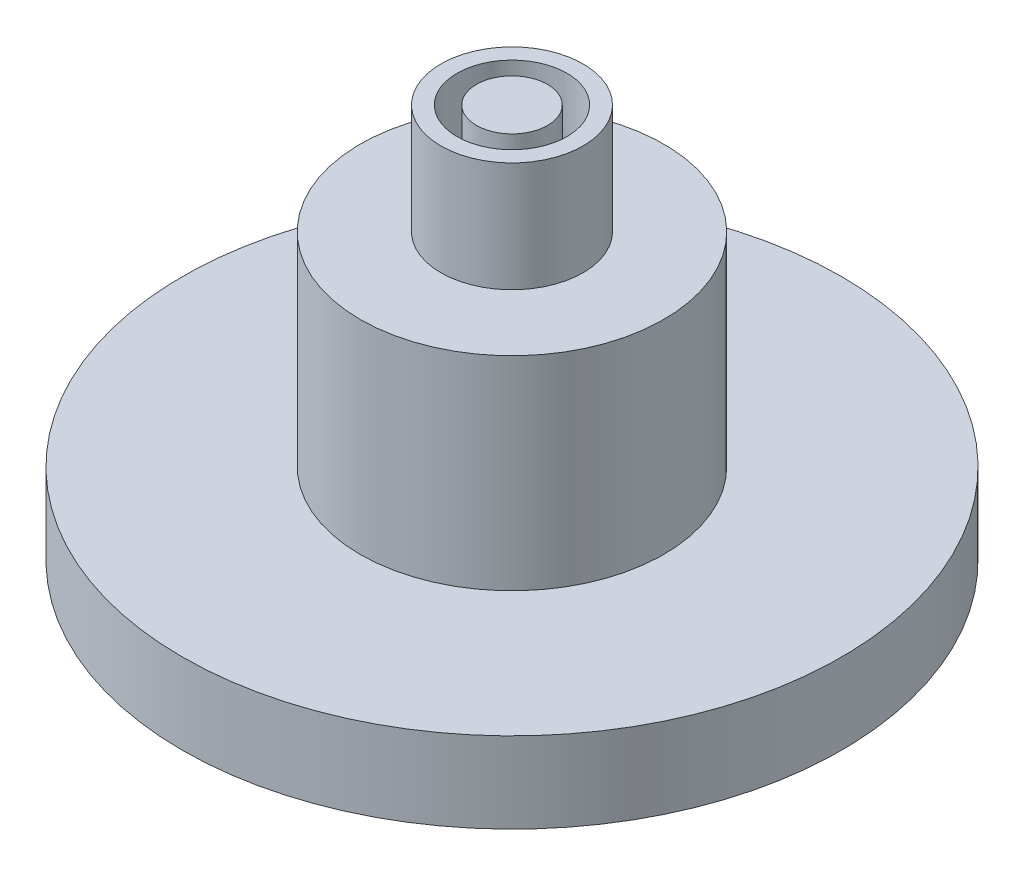
ISO-10303-21;
HEADER;
FILE_DESCRIPTION(('STEP AP214'),'2;1');
FILE_NAME('part.step','',(''),(''),'','','');
FILE_SCHEMA(('AUTOMOTIVE_DESIGN { 1 0 10303 214 1 1 1 1 }'));
ENDSEC;
DATA;
#1=APPLICATION_CONTEXT('core data for automotive mechanical design processes');
#2=APPLICATION_PROTOCOL_DEFINITION('international standard','automotive_design',2000,#1);
#3=PRODUCT_CONTEXT('',#1,'mechanical');
#4=PRODUCT('Part','Part','',(#3));
#5=PRODUCT_RELATED_PRODUCT_CATEGORY('part','',(#4));
#6=PRODUCT_DEFINITION_FORMATION('','',#4);
#7=PRODUCT_DEFINITION_CONTEXT('part definition',#1,'design');
#8=PRODUCT_DEFINITION('design','',#6,#7);
#9=PRODUCT_DEFINITION_SHAPE('','',#8);
#10=(LENGTH_UNIT() NAMED_UNIT(*) SI_UNIT(.MILLI.,.METRE.));
#11=(NAMED_UNIT(*) PLANE_ANGLE_UNIT() SI_UNIT($,.RADIAN.));
#12=(NAMED_UNIT(*) SI_UNIT($,.STERADIAN.) SOLID_ANGLE_UNIT());
#13=UNCERTAINTY_MEASURE_WITH_UNIT(LENGTH_MEASURE(1.E-05),#10,'distance_accuracy_value','');
#14=(GEOMETRIC_REPRESENTATION_CONTEXT(3) GLOBAL_UNCERTAINTY_ASSIGNED_CONTEXT((#13)) GLOBAL_UNIT_ASSIGNED_CONTEXT((#10,
#11,#12)) REPRESENTATION_CONTEXT('',''));
#15=CARTESIAN_POINT('',(0.,0.,0.));
#16=DIRECTION('',(0.,0.,1.));
#17=DIRECTION('',(1.,0.,0.));
#18=AXIS2_PLACEMENT_3D('',#15,#16,#17);
#19=CARTESIAN_POINT('',(0.,3.175,0.));
#20=DIRECTION('',(0.,-1.,0.));
#21=DIRECTION('',(0.,0.,-1.));
#22=AXIS2_PLACEMENT_3D('',#19,#20,#21);
#23=CYLINDRICAL_SURFACE('',#22,12.954);
#24=CARTESIAN_POINT('',(0.,3.175,0.));
#25=DIRECTION('',(0.,1.,0.));
#26=DIRECTION('',(0.,0.,1.));
#27=AXIS2_PLACEMENT_3D('',#24,#25,#26);
#28=CIRCLE('',#27,12.954);
#29=CARTESIAN_POINT('',(0.,3.175,12.954));
#30=VERTEX_POINT('',#29);
#31=EDGE_CURVE('E63',#30,#30,#28,.T.);
#32=ORIENTED_EDGE('',*,*,#31,.F.);
#33=EDGE_LOOP('',(#32));
#34=FACE_BOUND('',#33,.T.);
#35=CARTESIAN_POINT('',(0.,0.,0.));
#36=DIRECTION('',(0.,1.,0.));
#37=DIRECTION('',(0.,0.,1.));
#38=AXIS2_PLACEMENT_3D('',#35,#36,#37);
#39=CIRCLE('',#38,12.954);
#40=CARTESIAN_POINT('',(0.,0.,12.954));
#41=VERTEX_POINT('',#40);
#42=EDGE_CURVE('E72',#41,#41,#39,.T.);
#43=ORIENTED_EDGE('',*,*,#42,.T.);
#44=EDGE_LOOP('',(#43));
#45=FACE_BOUND('',#44,.T.);
#46=ADVANCED_FACE('F45',(#34,#45),#23,.T.);
#47=CARTESIAN_POINT('',(0.,3.175,0.));
#48=DIRECTION('',(0.,1.,0.));
#49=DIRECTION('',(0.,0.,1.));
#50=AXIS2_PLACEMENT_3D('',#47,#48,#49);
#51=PLANE('',#50);
#52=CARTESIAN_POINT('',(0.,3.175,0.));
#53=DIRECTION('',(0.,1.,0.));
#54=DIRECTION('',(0.,0.,1.));
#55=AXIS2_PLACEMENT_3D('',#52,#53,#54);
#56=CIRCLE('',#55,5.969);
#57=CARTESIAN_POINT('',(0.,3.175,5.969));
#58=VERTEX_POINT('',#57);
#59=EDGE_CURVE('E57',#58,#58,#56,.T.);
#60=ORIENTED_EDGE('',*,*,#59,.F.);
#61=EDGE_LOOP('',(#60));
#62=FACE_BOUND('',#61,.T.);
#63=ORIENTED_EDGE('',*,*,#31,.T.);
#64=EDGE_LOOP('',(#63));
#65=FACE_BOUND('',#64,.T.);
#66=ADVANCED_FACE('F84',(#62,#65),#51,.T.);
#67=CARTESIAN_POINT('',(0.,0.,0.));
#68=DIRECTION('',(0.,1.,0.));
#69=DIRECTION('',(0.,0.,1.));
#70=AXIS2_PLACEMENT_3D('',#67,#68,#69);
#71=PLANE('',#70);
#72=ORIENTED_EDGE('',*,*,#42,.F.);
#73=EDGE_LOOP('',(#72));
#74=FACE_BOUND('',#73,.T.);
#75=ADVANCED_FACE('F81',(#74),#71,.F.);
#76=CARTESIAN_POINT('',(0.,11.176,0.));
#77=DIRECTION('',(0.,-1.,0.));
#78=DIRECTION('',(0.,0.,-1.));
#79=AXIS2_PLACEMENT_3D('',#76,#77,#78);
#80=CYLINDRICAL_SURFACE('',#79,5.969);
#81=CARTESIAN_POINT('',(0.,11.176,0.));
#82=DIRECTION('',(0.,1.,0.));
#83=DIRECTION('',(0.,0.,1.));
#84=AXIS2_PLACEMENT_3D('',#81,#82,#83);
#85=CIRCLE('',#84,5.969);
#86=CARTESIAN_POINT('',(0.,11.176,5.969));
#87=VERTEX_POINT('',#86);
#88=EDGE_CURVE('E69',#87,#87,#85,.T.);
#89=ORIENTED_EDGE('',*,*,#88,.F.);
#90=EDGE_LOOP('',(#89));
#91=FACE_BOUND('',#90,.T.);
#92=ORIENTED_EDGE('',*,*,#59,.T.);
#93=EDGE_LOOP('',(#92));
#94=FACE_BOUND('',#93,.T.);
#95=ADVANCED_FACE('F83',(#91,#94),#80,.T.);
#96=CARTESIAN_POINT('',(0.,11.176,0.));
#97=DIRECTION('',(0.,1.,0.));
#98=DIRECTION('',(0.,0.,1.));
#99=AXIS2_PLACEMENT_3D('',#96,#97,#98);
#100=PLANE('',#99);
#101=CARTESIAN_POINT('',(0.,11.176,0.));
#102=DIRECTION('',(0.,1.,0.));
#103=DIRECTION('',(0.,0.,1.));
#104=AXIS2_PLACEMENT_3D('',#101,#102,#103);
#105=CIRCLE('',#104,2.794);
#106=CARTESIAN_POINT('',(0.,11.176,2.794));
#107=VERTEX_POINT('',#106);
#108=EDGE_CURVE('E197',#107,#107,#105,.T.);
#109=ORIENTED_EDGE('',*,*,#108,.F.);
#110=EDGE_LOOP('',(#109));
#111=FACE_BOUND('',#110,.T.);
#112=ORIENTED_EDGE('',*,*,#88,.T.);
#113=EDGE_LOOP('',(#112));
#114=FACE_BOUND('',#113,.T.);
#115=ADVANCED_FACE('F89',(#111,#114),#100,.T.);
#116=CARTESIAN_POINT('',(0.,15.494,0.));
#117=DIRECTION('',(0.,-1.,0.));
#118=DIRECTION('',(0.,0.,-1.));
#119=AXIS2_PLACEMENT_3D('',#116,#117,#118);
#120=CYLINDRICAL_SURFACE('',#119,2.159);
#121=CARTESIAN_POINT('',(0.,15.494,0.));
#122=DIRECTION('',(0.,1.,0.));
#123=DIRECTION('',(0.,0.,1.));
#124=AXIS2_PLACEMENT_3D('',#121,#122,#123);
#125=CIRCLE('',#124,2.159);
#126=CARTESIAN_POINT('',(0.,15.494,2.159));
#127=VERTEX_POINT('',#126);
#128=EDGE_CURVE('E191',#127,#127,#125,.T.);
#129=ORIENTED_EDGE('',*,*,#128,.T.);
#130=EDGE_LOOP('',(#129));
#131=FACE_BOUND('',#130,.T.);
#132=CARTESIAN_POINT('',(0.,11.176,0.));
#133=DIRECTION('',(0.,1.,0.));
#134=DIRECTION('',(0.,0.,1.));
#135=AXIS2_PLACEMENT_3D('',#132,#133,#134);
#136=CIRCLE('',#135,2.159);
#137=CARTESIAN_POINT('',(0.,11.176,2.159));
#138=VERTEX_POINT('',#137);
#139=EDGE_CURVE('E11',#138,#138,#136,.F.);
#140=ORIENTED_EDGE('',*,*,#139,.T.);
#141=EDGE_LOOP('',(#140));
#142=FACE_BOUND('',#141,.T.);
#143=ADVANCED_FACE('F121',(#131,#142),#120,.F.);
#144=CARTESIAN_POINT('',(0.,15.494,0.));
#145=DIRECTION('',(0.,-1.,0.));
#146=DIRECTION('',(0.,0.,-1.));
#147=AXIS2_PLACEMENT_3D('',#144,#145,#146);
#148=CYLINDRICAL_SURFACE('',#147,2.794);
#149=CARTESIAN_POINT('',(0.,15.494,0.));
#150=DIRECTION('',(0.,1.,0.));
#151=DIRECTION('',(0.,0.,1.));
#152=AXIS2_PLACEMENT_3D('',#149,#150,#151);
#153=CIRCLE('',#152,2.794);
#154=CARTESIAN_POINT('',(0.,15.494,2.794));
#155=VERTEX_POINT('',#154);
#156=EDGE_CURVE('E188',#155,#155,#153,.T.);
#157=ORIENTED_EDGE('',*,*,#156,.F.);
#158=EDGE_LOOP('',(#157));
#159=FACE_BOUND('',#158,.T.);
#160=ORIENTED_EDGE('',*,*,#108,.T.);
#161=EDGE_LOOP('',(#160));
#162=FACE_BOUND('',#161,.T.);
#163=ADVANCED_FACE('F133',(#159,#162),#148,.T.);
#164=CARTESIAN_POINT('',(0.,15.494,0.));
#165=DIRECTION('',(0.,1.,0.));
#166=DIRECTION('',(0.,0.,1.));
#167=AXIS2_PLACEMENT_3D('',#164,#165,#166);
#168=PLANE('',#167);
#169=ORIENTED_EDGE('',*,*,#128,.F.);
#170=EDGE_LOOP('',(#169));
#171=FACE_BOUND('',#170,.T.);
#172=ORIENTED_EDGE('',*,*,#156,.T.);
#173=EDGE_LOOP('',(#172));
#174=FACE_BOUND('',#173,.T.);
#175=ADVANCED_FACE('F143',(#171,#174),#168,.T.);
#176=CARTESIAN_POINT('',(0.,15.494,0.));
#177=DIRECTION('',(0.,1.,0.));
#178=DIRECTION('',(0.,0.,1.));
#179=AXIS2_PLACEMENT_3D('',#176,#177,#178);
#180=PLANE('',#179);
#181=CARTESIAN_POINT('',(0.,15.494,0.));
#182=DIRECTION('',(0.,1.,0.));
#183=DIRECTION('',(0.,0.,1.));
#184=AXIS2_PLACEMENT_3D('',#181,#182,#183);
#185=CIRCLE('',#184,1.397);
#186=CARTESIAN_POINT('',(0.,15.494,1.397));
#187=VERTEX_POINT('',#186);
#188=EDGE_CURVE('E67',#187,#187,#185,.T.);
#189=ORIENTED_EDGE('',*,*,#188,.T.);
#190=EDGE_LOOP('',(#189));
#191=FACE_BOUND('',#190,.T.);
#192=ADVANCED_FACE('F153',(#191),#180,.T.);
#193=CARTESIAN_POINT('',(0.,15.494,0.));
#194=DIRECTION('',(0.,-1.,0.));
#195=DIRECTION('',(0.,0.,-1.));
#196=AXIS2_PLACEMENT_3D('',#193,#194,#195);
#197=CYLINDRICAL_SURFACE('',#196,1.397);
#198=ORIENTED_EDGE('',*,*,#188,.F.);
#199=EDGE_LOOP('',(#198));
#200=FACE_BOUND('',#199,.T.);
#201=CARTESIAN_POINT('',(0.,11.176,0.));
#202=DIRECTION('',(0.,1.,0.));
#203=DIRECTION('',(0.,0.,1.));
#204=AXIS2_PLACEMENT_3D('',#201,#202,#203);
#205=CIRCLE('',#204,1.397);
#206=CARTESIAN_POINT('',(0.,11.176,1.397));
#207=VERTEX_POINT('',#206);
#208=EDGE_CURVE('E52',#207,#207,#205,.T.);
#209=ORIENTED_EDGE('',*,*,#208,.T.);
#210=EDGE_LOOP('',(#209));
#211=FACE_BOUND('',#210,.T.);
#212=ADVANCED_FACE('F163',(#200,#211),#197,.T.);
#213=ORIENTED_EDGE('',*,*,#208,.F.);
#214=EDGE_LOOP('',(#213));
#215=FACE_BOUND('',#214,.T.);
#216=ORIENTED_EDGE('',*,*,#139,.F.);
#217=EDGE_LOOP('',(#216));
#218=FACE_BOUND('',#217,.T.);
#219=ADVANCED_FACE('F124',(#215,#218),#100,.T.);
#220=CLOSED_SHELL('',(#46,#66,#75,#95,#115,#143,#163,#175,#192,#212,#219));
#221=MANIFOLD_SOLID_BREP('B2',#220);
#222=ADVANCED_BREP_SHAPE_REPRESENTATION('',(#18,#221),#14);
#223=SHAPE_DEFINITION_REPRESENTATION(#9,#222);
ENDSEC;
END-ISO-10303-21;
